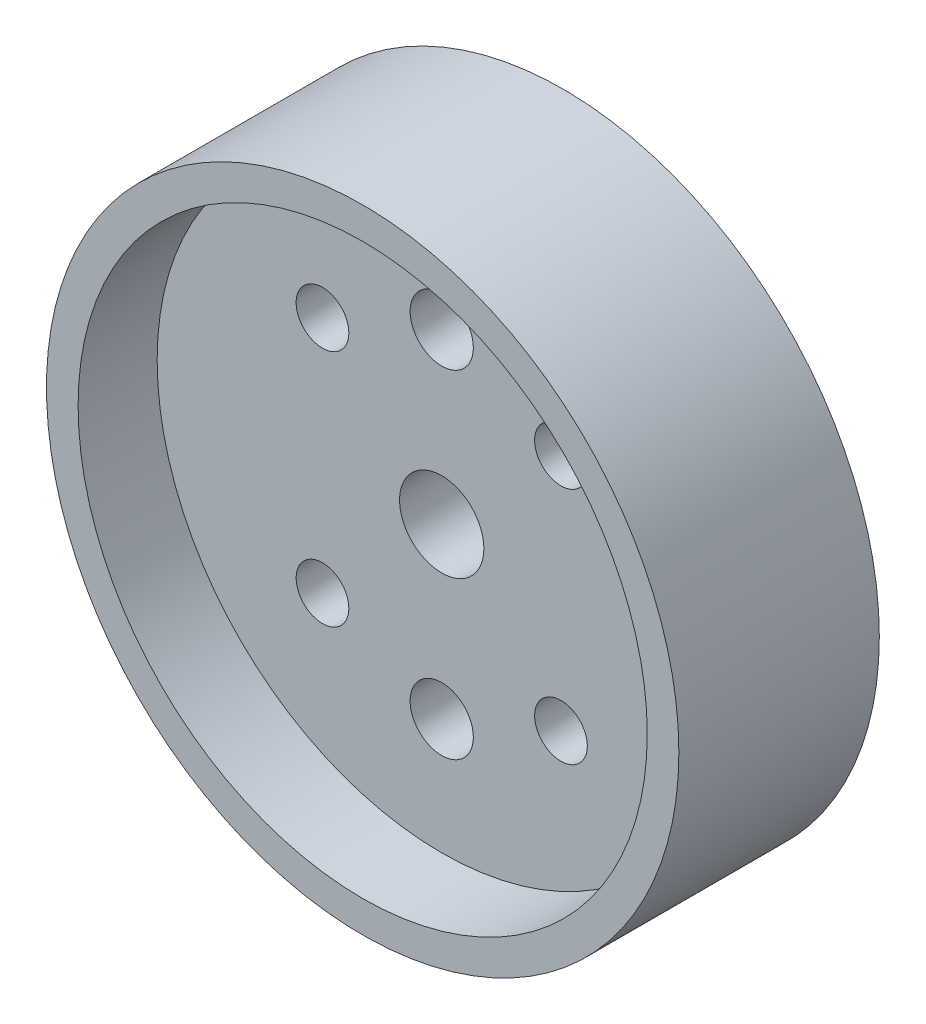
ISO-10303-21;
HEADER;
FILE_DESCRIPTION(('STEP AP214'),'2;1');
FILE_NAME('part.step','',(''),(''),'','','');
FILE_SCHEMA(('AUTOMOTIVE_DESIGN { 1 0 10303 214 1 1 1 1 }'));
ENDSEC;
DATA;
#1=APPLICATION_CONTEXT('core data for automotive mechanical design processes');
#2=APPLICATION_PROTOCOL_DEFINITION('international standard','automotive_design',2000,#1);
#3=PRODUCT_CONTEXT('',#1,'mechanical');
#4=PRODUCT('Part','Part','',(#3));
#5=PRODUCT_RELATED_PRODUCT_CATEGORY('part','',(#4));
#6=PRODUCT_DEFINITION_FORMATION('','',#4);
#7=PRODUCT_DEFINITION_CONTEXT('part definition',#1,'design');
#8=PRODUCT_DEFINITION('design','',#6,#7);
#9=PRODUCT_DEFINITION_SHAPE('','',#8);
#10=(LENGTH_UNIT() NAMED_UNIT(*) SI_UNIT(.MILLI.,.METRE.));
#11=(NAMED_UNIT(*) PLANE_ANGLE_UNIT() SI_UNIT($,.RADIAN.));
#12=(NAMED_UNIT(*) SI_UNIT($,.STERADIAN.) SOLID_ANGLE_UNIT());
#13=UNCERTAINTY_MEASURE_WITH_UNIT(LENGTH_MEASURE(1.E-05),#10,'distance_accuracy_value','');
#14=(GEOMETRIC_REPRESENTATION_CONTEXT(3) GLOBAL_UNCERTAINTY_ASSIGNED_CONTEXT((#13)) GLOBAL_UNIT_ASSIGNED_CONTEXT((#10,
#11,#12)) REPRESENTATION_CONTEXT('',''));
#15=CARTESIAN_POINT('',(0.,0.,0.));
#16=DIRECTION('',(0.,0.,1.));
#17=DIRECTION('',(1.,0.,0.));
#18=AXIS2_PLACEMENT_3D('',#15,#16,#17);
#19=CARTESIAN_POINT('',(0.,16.,0.));
#20=DIRECTION('',(0.,0.,1.));
#21=DIRECTION('',(1.,0.,0.));
#22=AXIS2_PLACEMENT_3D('',#19,#20,#21);
#23=CYLINDRICAL_SURFACE('',#22,3.);
#24=CARTESIAN_POINT('',(0.,16.,11.52));
#25=DIRECTION('',(0.,0.,1.));
#26=DIRECTION('',(1.,0.,0.));
#27=AXIS2_PLACEMENT_3D('',#24,#25,#26);
#28=CIRCLE('',#27,3.);
#29=CARTESIAN_POINT('',(3.,16.,11.52));
#30=VERTEX_POINT('',#29);
#31=EDGE_CURVE('E117',#30,#30,#28,.T.);
#32=ORIENTED_EDGE('',*,*,#31,.T.);
#33=EDGE_LOOP('',(#32));
#34=FACE_BOUND('',#33,.T.);
#35=CARTESIAN_POINT('',(0.,16.,6.));
#36=DIRECTION('',(0.,0.,-1.));
#37=DIRECTION('',(-1.,0.,0.));
#38=AXIS2_PLACEMENT_3D('',#35,#36,#37);
#39=CIRCLE('',#38,3.);
#40=CARTESIAN_POINT('',(-3.,16.,6.));
#41=VERTEX_POINT('',#40);
#42=EDGE_CURVE('E60',#41,#41,#39,.F.);
#43=ORIENTED_EDGE('',*,*,#42,.F.);
#44=EDGE_LOOP('',(#43));
#45=FACE_BOUND('',#44,.T.);
#46=ADVANCED_FACE('F56',(#34,#45),#23,.F.);
#47=CARTESIAN_POINT('',(11.3137084989848,-11.3137084989847,0.));
#48=DIRECTION('',(0.,0.,1.));
#49=DIRECTION('',(1.,0.,0.));
#50=AXIS2_PLACEMENT_3D('',#47,#48,#49);
#51=CYLINDRICAL_SURFACE('',#50,2.5);
#52=CARTESIAN_POINT('',(11.3137084989848,-11.3137084989847,11.52));
#53=DIRECTION('',(0.,0.,1.));
#54=DIRECTION('',(1.,0.,0.));
#55=AXIS2_PLACEMENT_3D('',#52,#53,#54);
#56=CIRCLE('',#55,2.5);
#57=CARTESIAN_POINT('',(13.8137084989848,-11.3137084989847,11.52));
#58=VERTEX_POINT('',#57);
#59=EDGE_CURVE('E101',#58,#58,#56,.T.);
#60=ORIENTED_EDGE('',*,*,#59,.T.);
#61=EDGE_LOOP('',(#60));
#62=FACE_BOUND('',#61,.T.);
#63=CARTESIAN_POINT('',(11.3137084989848,-11.3137084989847,6.));
#64=DIRECTION('',(0.,0.,-1.));
#65=DIRECTION('',(-1.,0.,0.));
#66=AXIS2_PLACEMENT_3D('',#63,#64,#65);
#67=CIRCLE('',#66,2.5);
#68=CARTESIAN_POINT('',(8.81370849898479,-11.3137084989847,6.));
#69=VERTEX_POINT('',#68);
#70=EDGE_CURVE('E87',#69,#69,#67,.F.);
#71=ORIENTED_EDGE('',*,*,#70,.F.);
#72=EDGE_LOOP('',(#71));
#73=FACE_BOUND('',#72,.T.);
#74=ADVANCED_FACE('F142',(#62,#73),#51,.F.);
#75=CARTESIAN_POINT('',(0.,-16.,0.));
#76=DIRECTION('',(0.,0.,1.));
#77=DIRECTION('',(1.,0.,0.));
#78=AXIS2_PLACEMENT_3D('',#75,#76,#77);
#79=CYLINDRICAL_SURFACE('',#78,3.);
#80=CARTESIAN_POINT('',(0.,-16.,11.52));
#81=DIRECTION('',(0.,0.,1.));
#82=DIRECTION('',(1.,0.,0.));
#83=AXIS2_PLACEMENT_3D('',#80,#81,#82);
#84=CIRCLE('',#83,3.);
#85=CARTESIAN_POINT('',(3.,-16.,11.52));
#86=VERTEX_POINT('',#85);
#87=EDGE_CURVE('E114',#86,#86,#84,.T.);
#88=ORIENTED_EDGE('',*,*,#87,.T.);
#89=EDGE_LOOP('',(#88));
#90=FACE_BOUND('',#89,.T.);
#91=CARTESIAN_POINT('',(0.,-16.,6.));
#92=DIRECTION('',(0.,0.,-1.));
#93=DIRECTION('',(-1.,0.,0.));
#94=AXIS2_PLACEMENT_3D('',#91,#92,#93);
#95=CIRCLE('',#94,3.);
#96=CARTESIAN_POINT('',(-3.,-16.,6.));
#97=VERTEX_POINT('',#96);
#98=EDGE_CURVE('E85',#97,#97,#95,.F.);
#99=ORIENTED_EDGE('',*,*,#98,.F.);
#100=EDGE_LOOP('',(#99));
#101=FACE_BOUND('',#100,.T.);
#102=ADVANCED_FACE('F148',(#90,#101),#79,.F.);
#103=CARTESIAN_POINT('',(-11.3137084989848,11.3137084989847,0.));
#104=DIRECTION('',(0.,0.,1.));
#105=DIRECTION('',(1.,0.,0.));
#106=AXIS2_PLACEMENT_3D('',#103,#104,#105);
#107=CYLINDRICAL_SURFACE('',#106,2.5);
#108=CARTESIAN_POINT('',(-11.3137084989848,11.3137084989847,11.52));
#109=DIRECTION('',(0.,0.,1.));
#110=DIRECTION('',(1.,0.,0.));
#111=AXIS2_PLACEMENT_3D('',#108,#109,#110);
#112=CIRCLE('',#111,2.5);
#113=CARTESIAN_POINT('',(-8.81370849898478,11.3137084989847,11.52));
#114=VERTEX_POINT('',#113);
#115=EDGE_CURVE('E111',#114,#114,#112,.T.);
#116=ORIENTED_EDGE('',*,*,#115,.T.);
#117=EDGE_LOOP('',(#116));
#118=FACE_BOUND('',#117,.T.);
#119=CARTESIAN_POINT('',(-11.3137084989848,11.3137084989847,6.));
#120=DIRECTION('',(0.,0.,-1.));
#121=DIRECTION('',(-1.,0.,0.));
#122=AXIS2_PLACEMENT_3D('',#119,#120,#121);
#123=CIRCLE('',#122,2.5);
#124=CARTESIAN_POINT('',(-13.8137084989848,11.3137084989847,6.));
#125=VERTEX_POINT('',#124);
#126=EDGE_CURVE('E82',#125,#125,#123,.F.);
#127=ORIENTED_EDGE('',*,*,#126,.F.);
#128=EDGE_LOOP('',(#127));
#129=FACE_BOUND('',#128,.T.);
#130=ADVANCED_FACE('F154',(#118,#129),#107,.F.);
#131=CARTESIAN_POINT('',(11.3137084989848,11.3137084989847,0.));
#132=DIRECTION('',(0.,0.,1.));
#133=DIRECTION('',(1.,0.,0.));
#134=AXIS2_PLACEMENT_3D('',#131,#132,#133);
#135=CYLINDRICAL_SURFACE('',#134,2.5);
#136=CARTESIAN_POINT('',(11.3137084989848,11.3137084989847,11.52));
#137=DIRECTION('',(0.,0.,1.));
#138=DIRECTION('',(1.,0.,0.));
#139=AXIS2_PLACEMENT_3D('',#136,#137,#138);
#140=CIRCLE('',#139,2.5);
#141=CARTESIAN_POINT('',(13.8137084989848,11.3137084989847,11.52));
#142=VERTEX_POINT('',#141);
#143=EDGE_CURVE('E108',#142,#142,#140,.T.);
#144=ORIENTED_EDGE('',*,*,#143,.T.);
#145=EDGE_LOOP('',(#144));
#146=FACE_BOUND('',#145,.T.);
#147=CARTESIAN_POINT('',(11.3137084989848,11.3137084989847,6.));
#148=DIRECTION('',(0.,0.,-1.));
#149=DIRECTION('',(-1.,0.,0.));
#150=AXIS2_PLACEMENT_3D('',#147,#148,#149);
#151=CIRCLE('',#150,2.5);
#152=CARTESIAN_POINT('',(8.81370849898478,11.3137084989847,6.));
#153=VERTEX_POINT('',#152);
#154=EDGE_CURVE('E78',#153,#153,#151,.F.);
#155=ORIENTED_EDGE('',*,*,#154,.F.);
#156=EDGE_LOOP('',(#155));
#157=FACE_BOUND('',#156,.T.);
#158=ADVANCED_FACE('F321',(#146,#157),#135,.F.);
#159=CARTESIAN_POINT('',(-11.3137084989848,-11.3137084989847,0.));
#160=DIRECTION('',(0.,0.,1.));
#161=DIRECTION('',(1.,0.,0.));
#162=AXIS2_PLACEMENT_3D('',#159,#160,#161);
#163=CYLINDRICAL_SURFACE('',#162,2.5);
#164=CARTESIAN_POINT('',(-11.3137084989848,-11.3137084989847,11.52));
#165=DIRECTION('',(0.,0.,1.));
#166=DIRECTION('',(1.,0.,0.));
#167=AXIS2_PLACEMENT_3D('',#164,#165,#166);
#168=CIRCLE('',#167,2.5);
#169=CARTESIAN_POINT('',(-8.81370849898478,-11.3137084989847,11.52));
#170=VERTEX_POINT('',#169);
#171=EDGE_CURVE('E107',#170,#170,#168,.T.);
#172=ORIENTED_EDGE('',*,*,#171,.T.);
#173=EDGE_LOOP('',(#172));
#174=FACE_BOUND('',#173,.T.);
#175=CARTESIAN_POINT('',(-11.3137084989848,-11.3137084989847,6.));
#176=DIRECTION('',(0.,0.,-1.));
#177=DIRECTION('',(-1.,0.,0.));
#178=AXIS2_PLACEMENT_3D('',#175,#176,#177);
#179=CIRCLE('',#178,2.5);
#180=CARTESIAN_POINT('',(-13.8137084989848,-11.3137084989847,6.));
#181=VERTEX_POINT('',#180);
#182=EDGE_CURVE('E75',#181,#181,#179,.F.);
#183=ORIENTED_EDGE('',*,*,#182,.F.);
#184=EDGE_LOOP('',(#183));
#185=FACE_BOUND('',#184,.T.);
#186=ADVANCED_FACE('F138',(#174,#185),#163,.F.);
#187=CARTESIAN_POINT('',(0.,0.,19.02));
#188=DIRECTION('',(0.,0.,-1.));
#189=DIRECTION('',(-1.,0.,0.));
#190=AXIS2_PLACEMENT_3D('',#187,#188,#189);
#191=CYLINDRICAL_SURFACE('',#190,30.);
#192=CARTESIAN_POINT('',(0.,0.,19.02));
#193=DIRECTION('',(0.,0.,1.));
#194=DIRECTION('',(1.,0.,0.));
#195=AXIS2_PLACEMENT_3D('',#192,#193,#194);
#196=CIRCLE('',#195,30.);
#197=CARTESIAN_POINT('',(30.,0.,19.02));
#198=VERTEX_POINT('',#197);
#199=EDGE_CURVE('E11',#198,#198,#196,.T.);
#200=ORIENTED_EDGE('',*,*,#199,.F.);
#201=EDGE_LOOP('',(#200));
#202=FACE_BOUND('',#201,.T.);
#203=CARTESIAN_POINT('',(0.,0.,0.));
#204=DIRECTION('',(0.,0.,1.));
#205=DIRECTION('',(1.,0.,0.));
#206=AXIS2_PLACEMENT_3D('',#203,#204,#205);
#207=CIRCLE('',#206,30.);
#208=CARTESIAN_POINT('',(30.,0.,0.));
#209=VERTEX_POINT('',#208);
#210=EDGE_CURVE('E64',#209,#209,#207,.T.);
#211=ORIENTED_EDGE('',*,*,#210,.T.);
#212=EDGE_LOOP('',(#211));
#213=FACE_BOUND('',#212,.T.);
#214=ADVANCED_FACE('F58',(#202,#213),#191,.T.);
#215=CARTESIAN_POINT('',(0.,0.,19.02));
#216=DIRECTION('',(0.,0.,1.));
#217=DIRECTION('',(1.,0.,0.));
#218=AXIS2_PLACEMENT_3D('',#215,#216,#217);
#219=PLANE('',#218);
#220=CARTESIAN_POINT('',(0.,0.,19.02));
#221=DIRECTION('',(0.,0.,1.));
#222=DIRECTION('',(1.,0.,0.));
#223=AXIS2_PLACEMENT_3D('',#220,#221,#222);
#224=CIRCLE('',#223,27.);
#225=CARTESIAN_POINT('',(27.,0.,19.02));
#226=VERTEX_POINT('',#225);
#227=EDGE_CURVE('E72',#226,#226,#224,.T.);
#228=ORIENTED_EDGE('',*,*,#227,.F.);
#229=EDGE_LOOP('',(#228));
#230=FACE_BOUND('',#229,.T.);
#231=ORIENTED_EDGE('',*,*,#199,.T.);
#232=EDGE_LOOP('',(#231));
#233=FACE_BOUND('',#232,.T.);
#234=ADVANCED_FACE('F129',(#230,#233),#219,.T.);
#235=CARTESIAN_POINT('',(0.,0.,0.));
#236=DIRECTION('',(0.,0.,1.));
#237=DIRECTION('',(1.,0.,0.));
#238=AXIS2_PLACEMENT_3D('',#235,#236,#237);
#239=PLANE('',#238);
#240=CARTESIAN_POINT('',(0.,-16.,0.));
#241=DIRECTION('',(0.,0.,-1.));
#242=DIRECTION('',(-1.,0.,0.));
#243=AXIS2_PLACEMENT_3D('',#240,#241,#242);
#244=CIRCLE('',#243,5.25);
#245=CARTESIAN_POINT('',(-5.25,-16.,0.));
#246=VERTEX_POINT('',#245);
#247=EDGE_CURVE('E399',#246,#246,#244,.T.);
#248=ORIENTED_EDGE('',*,*,#247,.F.);
#249=EDGE_LOOP('',(#248));
#250=FACE_BOUND('',#249,.T.);
#251=CARTESIAN_POINT('',(-11.3137084989848,11.3137084989847,0.));
#252=DIRECTION('',(0.,0.,-1.));
#253=DIRECTION('',(-1.,0.,0.));
#254=AXIS2_PLACEMENT_3D('',#251,#252,#253);
#255=CIRCLE('',#254,4.5);
#256=CARTESIAN_POINT('',(-15.8137084989848,11.3137084989847,0.));
#257=VERTEX_POINT('',#256);
#258=EDGE_CURVE('E415',#257,#257,#255,.T.);
#259=ORIENTED_EDGE('',*,*,#258,.F.);
#260=EDGE_LOOP('',(#259));
#261=FACE_BOUND('',#260,.T.);
#262=CARTESIAN_POINT('',(11.3137084989848,11.3137084989847,0.));
#263=DIRECTION('',(0.,0.,-1.));
#264=DIRECTION('',(-1.,0.,0.));
#265=AXIS2_PLACEMENT_3D('',#262,#263,#264);
#266=CIRCLE('',#265,4.5);
#267=CARTESIAN_POINT('',(6.81370849898478,11.3137084989847,0.));
#268=VERTEX_POINT('',#267);
#269=EDGE_CURVE('E409',#268,#268,#266,.T.);
#270=ORIENTED_EDGE('',*,*,#269,.F.);
#271=EDGE_LOOP('',(#270));
#272=FACE_BOUND('',#271,.T.);
#273=CARTESIAN_POINT('',(11.3137084989848,-11.3137084989847,0.));
#274=DIRECTION('',(0.,0.,-1.));
#275=DIRECTION('',(-1.,0.,0.));
#276=AXIS2_PLACEMENT_3D('',#273,#274,#275);
#277=CIRCLE('',#276,4.5);
#278=CARTESIAN_POINT('',(6.81370849898479,-11.3137084989847,0.));
#279=VERTEX_POINT('',#278);
#280=EDGE_CURVE('E402',#279,#279,#277,.T.);
#281=ORIENTED_EDGE('',*,*,#280,.F.);
#282=EDGE_LOOP('',(#281));
#283=FACE_BOUND('',#282,.T.);
#284=CARTESIAN_POINT('',(-11.3137084989848,-11.3137084989847,0.));
#285=DIRECTION('',(0.,0.,-1.));
#286=DIRECTION('',(-1.,0.,0.));
#287=AXIS2_PLACEMENT_3D('',#284,#285,#286);
#288=CIRCLE('',#287,4.5);
#289=CARTESIAN_POINT('',(-15.8137084989848,-11.3137084989847,0.));
#290=VERTEX_POINT('',#289);
#291=EDGE_CURVE('E423',#290,#290,#288,.T.);
#292=ORIENTED_EDGE('',*,*,#291,.F.);
#293=EDGE_LOOP('',(#292));
#294=FACE_BOUND('',#293,.T.);
#295=CARTESIAN_POINT('',(0.,16.,0.));
#296=DIRECTION('',(0.,0.,-1.));
#297=DIRECTION('',(-1.,0.,0.));
#298=AXIS2_PLACEMENT_3D('',#295,#296,#297);
#299=CIRCLE('',#298,5.25);
#300=CARTESIAN_POINT('',(-5.25,16.,0.));
#301=VERTEX_POINT('',#300);
#302=EDGE_CURVE('E394',#301,#301,#299,.T.);
#303=ORIENTED_EDGE('',*,*,#302,.F.);
#304=EDGE_LOOP('',(#303));
#305=FACE_BOUND('',#304,.T.);
#306=CARTESIAN_POINT('',(0.,0.,0.));
#307=DIRECTION('',(0.,0.,1.));
#308=DIRECTION('',(1.,0.,0.));
#309=AXIS2_PLACEMENT_3D('',#306,#307,#308);
#310=CIRCLE('',#309,4.);
#311=CARTESIAN_POINT('',(4.,0.,0.));
#312=VERTEX_POINT('',#311);
#313=EDGE_CURVE('E96',#312,#312,#310,.T.);
#314=ORIENTED_EDGE('',*,*,#313,.T.);
#315=EDGE_LOOP('',(#314));
#316=FACE_BOUND('',#315,.T.);
#317=ORIENTED_EDGE('',*,*,#210,.F.);
#318=EDGE_LOOP('',(#317));
#319=FACE_BOUND('',#318,.T.);
#320=ADVANCED_FACE('F131',(#250,#261,#272,#283,#294,#305,#316,#319),#239,.F.);
#321=CARTESIAN_POINT('',(0.,0.,11.52));
#322=DIRECTION('',(0.,0.,1.));
#323=DIRECTION('',(1.,0.,0.));
#324=AXIS2_PLACEMENT_3D('',#321,#322,#323);
#325=CYLINDRICAL_SURFACE('',#324,27.);
#326=CARTESIAN_POINT('',(0.,0.,11.52));
#327=DIRECTION('',(0.,0.,1.));
#328=DIRECTION('',(1.,0.,0.));
#329=AXIS2_PLACEMENT_3D('',#326,#327,#328);
#330=CIRCLE('',#329,27.);
#331=CARTESIAN_POINT('',(27.,0.,11.52));
#332=VERTEX_POINT('',#331);
#333=EDGE_CURVE('E69',#332,#332,#330,.T.);
#334=ORIENTED_EDGE('',*,*,#333,.F.);
#335=EDGE_LOOP('',(#334));
#336=FACE_BOUND('',#335,.T.);
#337=ORIENTED_EDGE('',*,*,#227,.T.);
#338=EDGE_LOOP('',(#337));
#339=FACE_BOUND('',#338,.T.);
#340=ADVANCED_FACE('F127',(#336,#339),#325,.F.);
#341=CARTESIAN_POINT('',(0.,0.,11.52));
#342=DIRECTION('',(0.,0.,1.));
#343=DIRECTION('',(1.,0.,0.));
#344=AXIS2_PLACEMENT_3D('',#341,#342,#343);
#345=PLANE('',#344);
#346=CARTESIAN_POINT('',(0.,0.,11.52));
#347=DIRECTION('',(0.,0.,1.));
#348=DIRECTION('',(1.,0.,0.));
#349=AXIS2_PLACEMENT_3D('',#346,#347,#348);
#350=CIRCLE('',#349,4.);
#351=CARTESIAN_POINT('',(4.,0.,11.52));
#352=VERTEX_POINT('',#351);
#353=EDGE_CURVE('E92',#352,#352,#350,.T.);
#354=ORIENTED_EDGE('',*,*,#353,.F.);
#355=EDGE_LOOP('',(#354));
#356=FACE_BOUND('',#355,.T.);
#357=ORIENTED_EDGE('',*,*,#171,.F.);
#358=EDGE_LOOP('',(#357));
#359=FACE_BOUND('',#358,.T.);
#360=ORIENTED_EDGE('',*,*,#143,.F.);
#361=EDGE_LOOP('',(#360));
#362=FACE_BOUND('',#361,.T.);
#363=ORIENTED_EDGE('',*,*,#115,.F.);
#364=EDGE_LOOP('',(#363));
#365=FACE_BOUND('',#364,.T.);
#366=ORIENTED_EDGE('',*,*,#87,.F.);
#367=EDGE_LOOP('',(#366));
#368=FACE_BOUND('',#367,.T.);
#369=ORIENTED_EDGE('',*,*,#59,.F.);
#370=EDGE_LOOP('',(#369));
#371=FACE_BOUND('',#370,.T.);
#372=ORIENTED_EDGE('',*,*,#31,.F.);
#373=EDGE_LOOP('',(#372));
#374=FACE_BOUND('',#373,.T.);
#375=ORIENTED_EDGE('',*,*,#333,.T.);
#376=EDGE_LOOP('',(#375));
#377=FACE_BOUND('',#376,.T.);
#378=ADVANCED_FACE('F156',(#356,#359,#362,#365,#368,#371,#374,#377),#345,.T.);
#379=CARTESIAN_POINT('',(0.,0.,0.));
#380=DIRECTION('',(0.,0.,1.));
#381=DIRECTION('',(1.,0.,0.));
#382=AXIS2_PLACEMENT_3D('',#379,#380,#381);
#383=CYLINDRICAL_SURFACE('',#382,4.);
#384=ORIENTED_EDGE('',*,*,#313,.F.);
#385=EDGE_LOOP('',(#384));
#386=FACE_BOUND('',#385,.T.);
#387=ORIENTED_EDGE('',*,*,#353,.T.);
#388=EDGE_LOOP('',(#387));
#389=FACE_BOUND('',#388,.T.);
#390=ADVANCED_FACE('F158',(#386,#389),#383,.F.);
#391=CARTESIAN_POINT('',(-11.3137084989848,-11.3137084989847,6.));
#392=DIRECTION('',(0.,0.,-1.));
#393=DIRECTION('',(-1.,0.,0.));
#394=AXIS2_PLACEMENT_3D('',#391,#392,#393);
#395=PLANE('',#394);
#396=CARTESIAN_POINT('',(-11.3137084989848,-11.3137084989847,6.));
#397=DIRECTION('',(0.,0.,-1.));
#398=DIRECTION('',(-1.,0.,0.));
#399=AXIS2_PLACEMENT_3D('',#396,#397,#398);
#400=CIRCLE('',#399,4.5);
#401=CARTESIAN_POINT('',(-15.8137084989848,-11.3137084989847,6.));
#402=VERTEX_POINT('',#401);
#403=EDGE_CURVE('E406',#402,#402,#400,.T.);
#404=ORIENTED_EDGE('',*,*,#403,.T.);
#405=EDGE_LOOP('',(#404));
#406=FACE_BOUND('',#405,.T.);
#407=ORIENTED_EDGE('',*,*,#182,.T.);
#408=EDGE_LOOP('',(#407));
#409=FACE_BOUND('',#408,.T.);
#410=ADVANCED_FACE('F176',(#406,#409),#395,.T.);
#411=CARTESIAN_POINT('',(-11.3137084989848,-11.3137084989847,6.));
#412=DIRECTION('',(0.,0.,-1.));
#413=DIRECTION('',(-1.,0.,0.));
#414=AXIS2_PLACEMENT_3D('',#411,#412,#413);
#415=CYLINDRICAL_SURFACE('',#414,4.5);
#416=ORIENTED_EDGE('',*,*,#403,.F.);
#417=EDGE_LOOP('',(#416));
#418=FACE_BOUND('',#417,.T.);
#419=ORIENTED_EDGE('',*,*,#291,.T.);
#420=EDGE_LOOP('',(#419));
#421=FACE_BOUND('',#420,.T.);
#422=ADVANCED_FACE('F184',(#418,#421),#415,.F.);
#423=CARTESIAN_POINT('',(11.3137084989848,11.3137084989847,6.));
#424=DIRECTION('',(0.,0.,-1.));
#425=DIRECTION('',(-1.,0.,0.));
#426=AXIS2_PLACEMENT_3D('',#423,#424,#425);
#427=PLANE('',#426);
#428=CARTESIAN_POINT('',(11.3137084989848,11.3137084989847,6.));
#429=DIRECTION('',(0.,0.,-1.));
#430=DIRECTION('',(-1.,0.,0.));
#431=AXIS2_PLACEMENT_3D('',#428,#429,#430);
#432=CIRCLE('',#431,4.5);
#433=CARTESIAN_POINT('',(6.81370849898478,11.3137084989847,6.));
#434=VERTEX_POINT('',#433);
#435=EDGE_CURVE('E412',#434,#434,#432,.T.);
#436=ORIENTED_EDGE('',*,*,#435,.T.);
#437=EDGE_LOOP('',(#436));
#438=FACE_BOUND('',#437,.T.);
#439=ORIENTED_EDGE('',*,*,#154,.T.);
#440=EDGE_LOOP('',(#439));
#441=FACE_BOUND('',#440,.T.);
#442=ADVANCED_FACE('F192',(#438,#441),#427,.T.);
#443=CARTESIAN_POINT('',(11.3137084989848,11.3137084989847,6.));
#444=DIRECTION('',(0.,0.,-1.));
#445=DIRECTION('',(-1.,0.,0.));
#446=AXIS2_PLACEMENT_3D('',#443,#444,#445);
#447=CYLINDRICAL_SURFACE('',#446,4.5);
#448=ORIENTED_EDGE('',*,*,#435,.F.);
#449=EDGE_LOOP('',(#448));
#450=FACE_BOUND('',#449,.T.);
#451=ORIENTED_EDGE('',*,*,#269,.T.);
#452=EDGE_LOOP('',(#451));
#453=FACE_BOUND('',#452,.T.);
#454=ADVANCED_FACE('F200',(#450,#453),#447,.F.);
#455=CARTESIAN_POINT('',(-11.3137084989848,11.3137084989847,6.));
#456=DIRECTION('',(0.,0.,-1.));
#457=DIRECTION('',(-1.,0.,0.));
#458=AXIS2_PLACEMENT_3D('',#455,#456,#457);
#459=PLANE('',#458);
#460=CARTESIAN_POINT('',(-11.3137084989848,11.3137084989847,6.));
#461=DIRECTION('',(0.,0.,-1.));
#462=DIRECTION('',(-1.,0.,0.));
#463=AXIS2_PLACEMENT_3D('',#460,#461,#462);
#464=CIRCLE('',#463,4.5);
#465=CARTESIAN_POINT('',(-15.8137084989848,11.3137084989847,6.));
#466=VERTEX_POINT('',#465);
#467=EDGE_CURVE('E418',#466,#466,#464,.T.);
#468=ORIENTED_EDGE('',*,*,#467,.T.);
#469=EDGE_LOOP('',(#468));
#470=FACE_BOUND('',#469,.T.);
#471=ORIENTED_EDGE('',*,*,#126,.T.);
#472=EDGE_LOOP('',(#471));
#473=FACE_BOUND('',#472,.T.);
#474=ADVANCED_FACE('F208',(#470,#473),#459,.T.);
#475=CARTESIAN_POINT('',(-11.3137084989848,11.3137084989847,6.));
#476=DIRECTION('',(0.,0.,-1.));
#477=DIRECTION('',(-1.,0.,0.));
#478=AXIS2_PLACEMENT_3D('',#475,#476,#477);
#479=CYLINDRICAL_SURFACE('',#478,4.5);
#480=ORIENTED_EDGE('',*,*,#467,.F.);
#481=EDGE_LOOP('',(#480));
#482=FACE_BOUND('',#481,.T.);
#483=ORIENTED_EDGE('',*,*,#258,.T.);
#484=EDGE_LOOP('',(#483));
#485=FACE_BOUND('',#484,.T.);
#486=ADVANCED_FACE('F216',(#482,#485),#479,.F.);
#487=CARTESIAN_POINT('',(0.,-16.,6.));
#488=DIRECTION('',(0.,0.,-1.));
#489=DIRECTION('',(-1.,0.,0.));
#490=AXIS2_PLACEMENT_3D('',#487,#488,#489);
#491=PLANE('',#490);
#492=CARTESIAN_POINT('',(0.,-16.,6.));
#493=DIRECTION('',(0.,0.,-1.));
#494=DIRECTION('',(-1.,0.,0.));
#495=AXIS2_PLACEMENT_3D('',#492,#493,#494);
#496=CIRCLE('',#495,5.25);
#497=CARTESIAN_POINT('',(-5.25,-16.,6.));
#498=VERTEX_POINT('',#497);
#499=EDGE_CURVE('E396',#498,#498,#496,.T.);
#500=ORIENTED_EDGE('',*,*,#499,.T.);
#501=EDGE_LOOP('',(#500));
#502=FACE_BOUND('',#501,.T.);
#503=ORIENTED_EDGE('',*,*,#98,.T.);
#504=EDGE_LOOP('',(#503));
#505=FACE_BOUND('',#504,.T.);
#506=ADVANCED_FACE('F224',(#502,#505),#491,.T.);
#507=CARTESIAN_POINT('',(0.,-16.,6.));
#508=DIRECTION('',(0.,0.,-1.));
#509=DIRECTION('',(-1.,0.,0.));
#510=AXIS2_PLACEMENT_3D('',#507,#508,#509);
#511=CYLINDRICAL_SURFACE('',#510,5.25);
#512=ORIENTED_EDGE('',*,*,#499,.F.);
#513=EDGE_LOOP('',(#512));
#514=FACE_BOUND('',#513,.T.);
#515=ORIENTED_EDGE('',*,*,#247,.T.);
#516=EDGE_LOOP('',(#515));
#517=FACE_BOUND('',#516,.T.);
#518=ADVANCED_FACE('F232',(#514,#517),#511,.F.);
#519=CARTESIAN_POINT('',(11.3137084989848,-11.3137084989847,6.));
#520=DIRECTION('',(0.,0.,-1.));
#521=DIRECTION('',(-1.,0.,0.));
#522=AXIS2_PLACEMENT_3D('',#519,#520,#521);
#523=PLANE('',#522);
#524=CARTESIAN_POINT('',(11.3137084989848,-11.3137084989847,6.));
#525=DIRECTION('',(0.,0.,-1.));
#526=DIRECTION('',(-1.,0.,0.));
#527=AXIS2_PLACEMENT_3D('',#524,#525,#526);
#528=CIRCLE('',#527,4.5);
#529=CARTESIAN_POINT('',(6.81370849898479,-11.3137084989847,6.));
#530=VERTEX_POINT('',#529);
#531=EDGE_CURVE('E405',#530,#530,#528,.T.);
#532=ORIENTED_EDGE('',*,*,#531,.T.);
#533=EDGE_LOOP('',(#532));
#534=FACE_BOUND('',#533,.T.);
#535=ORIENTED_EDGE('',*,*,#70,.T.);
#536=EDGE_LOOP('',(#535));
#537=FACE_BOUND('',#536,.T.);
#538=ADVANCED_FACE('F240',(#534,#537),#523,.T.);
#539=CARTESIAN_POINT('',(11.3137084989848,-11.3137084989847,6.));
#540=DIRECTION('',(0.,0.,-1.));
#541=DIRECTION('',(-1.,0.,0.));
#542=AXIS2_PLACEMENT_3D('',#539,#540,#541);
#543=CYLINDRICAL_SURFACE('',#542,4.5);
#544=ORIENTED_EDGE('',*,*,#531,.F.);
#545=EDGE_LOOP('',(#544));
#546=FACE_BOUND('',#545,.T.);
#547=ORIENTED_EDGE('',*,*,#280,.T.);
#548=EDGE_LOOP('',(#547));
#549=FACE_BOUND('',#548,.T.);
#550=ADVANCED_FACE('F248',(#546,#549),#543,.F.);
#551=CARTESIAN_POINT('',(0.,16.,6.));
#552=DIRECTION('',(0.,0.,-1.));
#553=DIRECTION('',(-1.,0.,0.));
#554=AXIS2_PLACEMENT_3D('',#551,#552,#553);
#555=PLANE('',#554);
#556=CARTESIAN_POINT('',(0.,16.,6.));
#557=DIRECTION('',(0.,0.,-1.));
#558=DIRECTION('',(-1.,0.,0.));
#559=AXIS2_PLACEMENT_3D('',#556,#557,#558);
#560=CIRCLE('',#559,5.25);
#561=CARTESIAN_POINT('',(-5.25,16.,6.));
#562=VERTEX_POINT('',#561);
#563=EDGE_CURVE('E79',#562,#562,#560,.T.);
#564=ORIENTED_EDGE('',*,*,#563,.T.);
#565=EDGE_LOOP('',(#564));
#566=FACE_BOUND('',#565,.T.);
#567=ORIENTED_EDGE('',*,*,#42,.T.);
#568=EDGE_LOOP('',(#567));
#569=FACE_BOUND('',#568,.T.);
#570=ADVANCED_FACE('F256',(#566,#569),#555,.T.);
#571=CARTESIAN_POINT('',(0.,16.,6.));
#572=DIRECTION('',(0.,0.,-1.));
#573=DIRECTION('',(-1.,0.,0.));
#574=AXIS2_PLACEMENT_3D('',#571,#572,#573);
#575=CYLINDRICAL_SURFACE('',#574,5.25);
#576=ORIENTED_EDGE('',*,*,#563,.F.);
#577=EDGE_LOOP('',(#576));
#578=FACE_BOUND('',#577,.T.);
#579=ORIENTED_EDGE('',*,*,#302,.T.);
#580=EDGE_LOOP('',(#579));
#581=FACE_BOUND('',#580,.T.);
#582=ADVANCED_FACE('F264',(#578,#581),#575,.F.);
#583=CLOSED_SHELL('',(#46,#74,#102,#130,#158,#186,#214,#234,#320,#340,#378,#390,#410,#422,#442,
#454,#474,#486,#506,#518,#538,#550,#570,#582));
#584=MANIFOLD_SOLID_BREP('B2',#583);
#585=ADVANCED_BREP_SHAPE_REPRESENTATION('',(#18,#584),#14);
#586=SHAPE_DEFINITION_REPRESENTATION(#9,#585);
ENDSEC;
END-ISO-10303-21;
